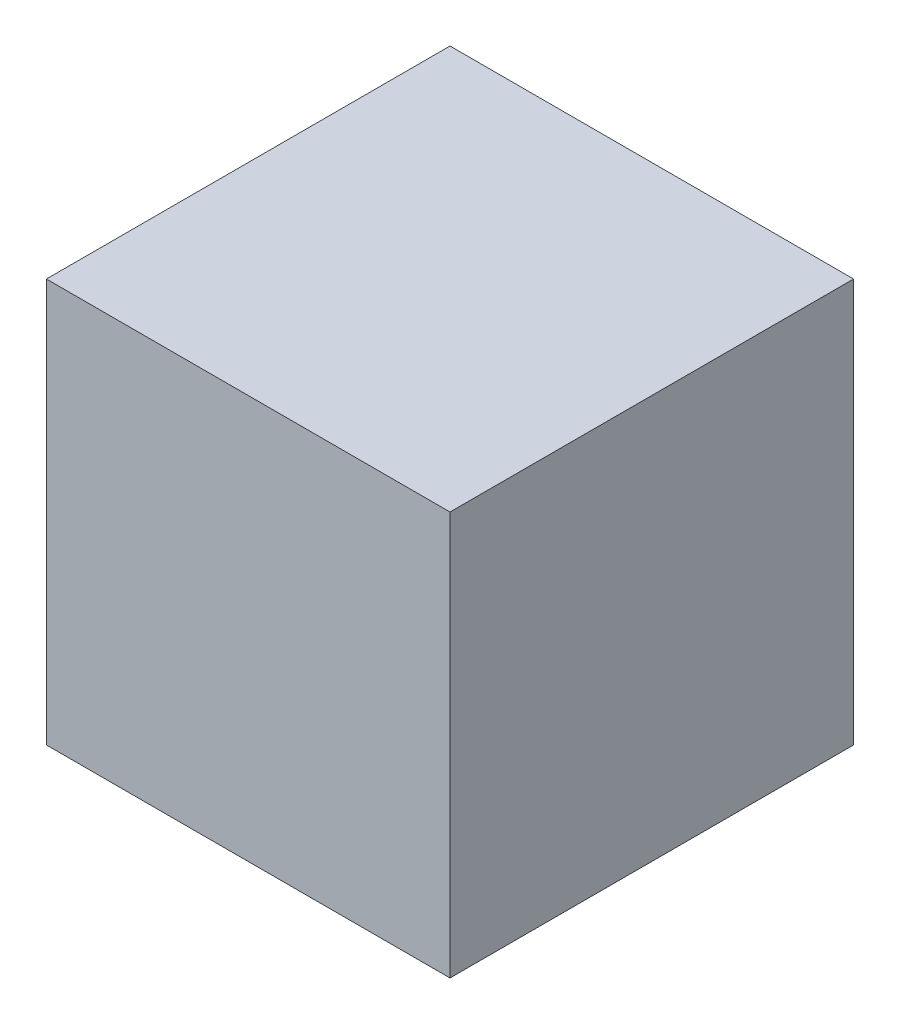
ISO-10303-21;
HEADER;
FILE_DESCRIPTION(('STEP AP214'),'2;1');
FILE_NAME('part.step','',(''),(''),'','','');
FILE_SCHEMA(('AUTOMOTIVE_DESIGN { 1 0 10303 214 1 1 1 1 }'));
ENDSEC;
DATA;
#1=APPLICATION_CONTEXT('core data for automotive mechanical design processes');
#2=APPLICATION_PROTOCOL_DEFINITION('international standard','automotive_design',2000,#1);
#3=PRODUCT_CONTEXT('',#1,'mechanical');
#4=PRODUCT('Part','Part','',(#3));
#5=PRODUCT_RELATED_PRODUCT_CATEGORY('part','',(#4));
#6=PRODUCT_DEFINITION_FORMATION('','',#4);
#7=PRODUCT_DEFINITION_CONTEXT('part definition',#1,'design');
#8=PRODUCT_DEFINITION('design','',#6,#7);
#9=PRODUCT_DEFINITION_SHAPE('','',#8);
#10=(LENGTH_UNIT() NAMED_UNIT(*) SI_UNIT(.MILLI.,.METRE.));
#11=(NAMED_UNIT(*) PLANE_ANGLE_UNIT() SI_UNIT($,.RADIAN.));
#12=(NAMED_UNIT(*) SI_UNIT($,.STERADIAN.) SOLID_ANGLE_UNIT());
#13=UNCERTAINTY_MEASURE_WITH_UNIT(LENGTH_MEASURE(1.E-05),#10,'distance_accuracy_value','');
#14=(GEOMETRIC_REPRESENTATION_CONTEXT(3) GLOBAL_UNCERTAINTY_ASSIGNED_CONTEXT((#13)) GLOBAL_UNIT_ASSIGNED_CONTEXT((#10,
#11,#12)) REPRESENTATION_CONTEXT('',''));
#15=CARTESIAN_POINT('',(0.,0.,0.));
#16=DIRECTION('',(0.,0.,1.));
#17=DIRECTION('',(1.,0.,0.));
#18=AXIS2_PLACEMENT_3D('',#15,#16,#17);
#19=CARTESIAN_POINT('',(0.,50.8,0.));
#20=DIRECTION('',(0.,1.,0.));
#21=DIRECTION('',(0.,0.,1.));
#22=AXIS2_PLACEMENT_3D('',#19,#20,#21);
#23=PLANE('',#22);
#24=DIRECTION('',(0.,0.,1.));
#25=VECTOR('',#24,1.);
#26=CARTESIAN_POINT('',(0.,50.8,0.));
#27=LINE('',#26,#25);
#28=CARTESIAN_POINT('',(0.,50.8,-50.8));
#29=VERTEX_POINT('',#28);
#30=CARTESIAN_POINT('',(0.,50.8,0.));
#31=VERTEX_POINT('',#30);
#32=EDGE_CURVE('E158',#29,#31,#27,.T.);
#33=ORIENTED_EDGE('',*,*,#32,.T.);
#34=DIRECTION('',(1.,0.,0.));
#35=VECTOR('',#34,1.);
#36=CARTESIAN_POINT('',(0.,50.8,0.));
#37=LINE('',#36,#35);
#38=CARTESIAN_POINT('',(50.8,50.8,0.));
#39=VERTEX_POINT('',#38);
#40=EDGE_CURVE('E161',#31,#39,#37,.T.);
#41=ORIENTED_EDGE('',*,*,#40,.T.);
#42=DIRECTION('',(0.,0.,-1.));
#43=VECTOR('',#42,1.);
#44=CARTESIAN_POINT('',(50.8,50.8,0.));
#45=LINE('',#44,#43);
#46=CARTESIAN_POINT('',(50.8,50.8,-50.8));
#47=VERTEX_POINT('',#46);
#48=EDGE_CURVE('E164',#39,#47,#45,.T.);
#49=ORIENTED_EDGE('',*,*,#48,.T.);
#50=DIRECTION('',(-1.,0.,0.));
#51=VECTOR('',#50,1.);
#52=CARTESIAN_POINT('',(0.,50.8,-50.8));
#53=LINE('',#52,#51);
#54=EDGE_CURVE('E166',#47,#29,#53,.T.);
#55=ORIENTED_EDGE('',*,*,#54,.T.);
#56=EDGE_LOOP('',(#33,#41,#49,#55));
#57=FACE_BOUND('',#56,.T.);
#58=ADVANCED_FACE('F58',(#57),#23,.T.);
#59=CARTESIAN_POINT('',(0.,0.,0.));
#60=DIRECTION('',(0.,1.,0.));
#61=DIRECTION('',(0.,0.,1.));
#62=AXIS2_PLACEMENT_3D('',#59,#60,#61);
#63=PLANE('',#62);
#64=DIRECTION('',(0.,0.,1.));
#65=VECTOR('',#64,1.);
#66=CARTESIAN_POINT('',(0.,0.,0.));
#67=LINE('',#66,#65);
#68=CARTESIAN_POINT('',(0.,0.,-50.8));
#69=VERTEX_POINT('',#68);
#70=CARTESIAN_POINT('',(0.,0.,0.));
#71=VERTEX_POINT('',#70);
#72=EDGE_CURVE('E157',#69,#71,#67,.T.);
#73=ORIENTED_EDGE('',*,*,#72,.F.);
#74=DIRECTION('',(-1.,0.,0.));
#75=VECTOR('',#74,1.);
#76=CARTESIAN_POINT('',(0.,0.,-50.8));
#77=LINE('',#76,#75);
#78=CARTESIAN_POINT('',(50.8,0.,-50.8));
#79=VERTEX_POINT('',#78);
#80=EDGE_CURVE('E162',#79,#69,#77,.T.);
#81=ORIENTED_EDGE('',*,*,#80,.F.);
#82=DIRECTION('',(0.,0.,-1.));
#83=VECTOR('',#82,1.);
#84=CARTESIAN_POINT('',(50.8,0.,0.));
#85=LINE('',#84,#83);
#86=CARTESIAN_POINT('',(50.8,0.,0.));
#87=VERTEX_POINT('',#86);
#88=EDGE_CURVE('E173',#87,#79,#85,.T.);
#89=ORIENTED_EDGE('',*,*,#88,.F.);
#90=DIRECTION('',(1.,0.,0.));
#91=VECTOR('',#90,1.);
#92=CARTESIAN_POINT('',(0.,0.,0.));
#93=LINE('',#92,#91);
#94=EDGE_CURVE('E171',#71,#87,#93,.T.);
#95=ORIENTED_EDGE('',*,*,#94,.F.);
#96=EDGE_LOOP('',(#73,#81,#89,#95));
#97=FACE_BOUND('',#96,.T.);
#98=ADVANCED_FACE('F194',(#97),#63,.F.);
#99=CARTESIAN_POINT('',(0.,50.8,0.));
#100=DIRECTION('',(1.,0.,0.));
#101=DIRECTION('',(0.,0.,-1.));
#102=AXIS2_PLACEMENT_3D('',#99,#100,#101);
#103=PLANE('',#102);
#104=ORIENTED_EDGE('',*,*,#72,.T.);
#105=DIRECTION('',(0.,-1.,0.));
#106=VECTOR('',#105,1.);
#107=CARTESIAN_POINT('',(0.,50.8,0.));
#108=LINE('',#107,#106);
#109=EDGE_CURVE('E67',#31,#71,#108,.T.);
#110=ORIENTED_EDGE('',*,*,#109,.F.);
#111=ORIENTED_EDGE('',*,*,#32,.F.);
#112=DIRECTION('',(0.,-1.,0.));
#113=VECTOR('',#112,1.);
#114=CARTESIAN_POINT('',(0.,50.8,-50.8));
#115=LINE('',#114,#113);
#116=EDGE_CURVE('E168',#29,#69,#115,.T.);
#117=ORIENTED_EDGE('',*,*,#116,.T.);
#118=EDGE_LOOP('',(#104,#110,#111,#117));
#119=FACE_BOUND('',#118,.T.);
#120=ADVANCED_FACE('F60',(#119),#103,.F.);
#121=CARTESIAN_POINT('',(0.,50.8,0.));
#122=DIRECTION('',(0.,0.,-1.));
#123=DIRECTION('',(-1.,0.,0.));
#124=AXIS2_PLACEMENT_3D('',#121,#122,#123);
#125=PLANE('',#124);
#126=ORIENTED_EDGE('',*,*,#94,.T.);
#127=DIRECTION('',(0.,-1.,0.));
#128=VECTOR('',#127,1.);
#129=CARTESIAN_POINT('',(50.8,50.8,0.));
#130=LINE('',#129,#128);
#131=EDGE_CURVE('E181',#39,#87,#130,.T.);
#132=ORIENTED_EDGE('',*,*,#131,.F.);
#133=ORIENTED_EDGE('',*,*,#40,.F.);
#134=ORIENTED_EDGE('',*,*,#109,.T.);
#135=EDGE_LOOP('',(#126,#132,#133,#134));
#136=FACE_BOUND('',#135,.T.);
#137=ADVANCED_FACE('F186',(#136),#125,.F.);
#138=CARTESIAN_POINT('',(50.8,50.8,0.));
#139=DIRECTION('',(-1.,0.,0.));
#140=DIRECTION('',(0.,0.,1.));
#141=AXIS2_PLACEMENT_3D('',#138,#139,#140);
#142=PLANE('',#141);
#143=ORIENTED_EDGE('',*,*,#88,.T.);
#144=DIRECTION('',(0.,-1.,0.));
#145=VECTOR('',#144,1.);
#146=CARTESIAN_POINT('',(50.8,50.8,-50.8));
#147=LINE('',#146,#145);
#148=EDGE_CURVE('E178',#47,#79,#147,.T.);
#149=ORIENTED_EDGE('',*,*,#148,.F.);
#150=ORIENTED_EDGE('',*,*,#48,.F.);
#151=ORIENTED_EDGE('',*,*,#131,.T.);
#152=EDGE_LOOP('',(#143,#149,#150,#151));
#153=FACE_BOUND('',#152,.T.);
#154=ADVANCED_FACE('F198',(#153),#142,.F.);
#155=CARTESIAN_POINT('',(0.,50.8,-50.8));
#156=DIRECTION('',(0.,0.,1.));
#157=DIRECTION('',(1.,0.,0.));
#158=AXIS2_PLACEMENT_3D('',#155,#156,#157);
#159=PLANE('',#158);
#160=ORIENTED_EDGE('',*,*,#80,.T.);
#161=ORIENTED_EDGE('',*,*,#116,.F.);
#162=ORIENTED_EDGE('',*,*,#54,.F.);
#163=ORIENTED_EDGE('',*,*,#148,.T.);
#164=EDGE_LOOP('',(#160,#161,#162,#163));
#165=FACE_BOUND('',#164,.T.);
#166=ADVANCED_FACE('F202',(#165),#159,.F.);
#167=CLOSED_SHELL('',(#58,#98,#120,#137,#154,#166));
#168=CARTESIAN_POINT('',(0.,6.35,0.));
#169=DIRECTION('',(0.,1.,0.));
#170=DIRECTION('',(0.,0.,1.));
#171=AXIS2_PLACEMENT_3D('',#168,#169,#170);
#172=PLANE('',#171);
#173=DIRECTION('',(0.,0.,-1.));
#174=VECTOR('',#173,1.);
#175=CARTESIAN_POINT('',(6.35,6.35,-44.45));
#176=LINE('',#175,#174);
#177=CARTESIAN_POINT('',(6.35,6.35,-6.35));
#178=VERTEX_POINT('',#177);
#179=CARTESIAN_POINT('',(6.35,6.35,-44.45));
#180=VERTEX_POINT('',#179);
#181=EDGE_CURVE('E137',#178,#180,#176,.T.);
#182=ORIENTED_EDGE('',*,*,#181,.F.);
#183=DIRECTION('',(1.,0.,0.));
#184=VECTOR('',#183,1.);
#185=CARTESIAN_POINT('',(0.,6.35,-6.35));
#186=LINE('',#185,#184);
#187=CARTESIAN_POINT('',(44.45,6.35,-6.35));
#188=VERTEX_POINT('',#187);
#189=EDGE_CURVE('E74',#178,#188,#186,.T.);
#190=ORIENTED_EDGE('',*,*,#189,.T.);
#191=DIRECTION('',(0.,0.,1.));
#192=VECTOR('',#191,1.);
#193=CARTESIAN_POINT('',(44.45,6.35,-44.45));
#194=LINE('',#193,#192);
#195=CARTESIAN_POINT('',(44.45,6.35,-44.45));
#196=VERTEX_POINT('',#195);
#197=EDGE_CURVE('E82',#196,#188,#194,.T.);
#198=ORIENTED_EDGE('',*,*,#197,.F.);
#199=DIRECTION('',(1.,0.,0.));
#200=VECTOR('',#199,1.);
#201=CARTESIAN_POINT('',(6.35,6.35,-44.45));
#202=LINE('',#201,#200);
#203=EDGE_CURVE('E130',#180,#196,#202,.T.);
#204=ORIENTED_EDGE('',*,*,#203,.F.);
#205=EDGE_LOOP('',(#182,#190,#198,#204));
#206=FACE_BOUND('',#205,.T.);
#207=ADVANCED_FACE('F142',(#206),#172,.T.);
#208=CARTESIAN_POINT('',(0.,44.45,0.));
#209=DIRECTION('',(0.,-1.,0.));
#210=DIRECTION('',(0.,0.,-1.));
#211=AXIS2_PLACEMENT_3D('',#208,#209,#210);
#212=PLANE('',#211);
#213=DIRECTION('',(0.,0.,1.));
#214=VECTOR('',#213,1.);
#215=CARTESIAN_POINT('',(6.35,44.45,-6.35));
#216=LINE('',#215,#214);
#217=CARTESIAN_POINT('',(6.35,44.45,-44.45));
#218=VERTEX_POINT('',#217);
#219=CARTESIAN_POINT('',(6.35,44.45,-6.35));
#220=VERTEX_POINT('',#219);
#221=EDGE_CURVE('E147',#218,#220,#216,.T.);
#222=ORIENTED_EDGE('',*,*,#221,.F.);
#223=DIRECTION('',(1.,0.,0.));
#224=VECTOR('',#223,1.);
#225=CARTESIAN_POINT('',(0.,44.45,-44.45));
#226=LINE('',#225,#224);
#227=CARTESIAN_POINT('',(44.45,44.45,-44.45));
#228=VERTEX_POINT('',#227);
#229=EDGE_CURVE('E12',#218,#228,#226,.T.);
#230=ORIENTED_EDGE('',*,*,#229,.T.);
#231=DIRECTION('',(0.,0.,-1.));
#232=VECTOR('',#231,1.);
#233=CARTESIAN_POINT('',(44.45,44.45,-6.35));
#234=LINE('',#233,#232);
#235=CARTESIAN_POINT('',(44.45,44.45,-6.35));
#236=VERTEX_POINT('',#235);
#237=EDGE_CURVE('E134',#236,#228,#234,.T.);
#238=ORIENTED_EDGE('',*,*,#237,.F.);
#239=DIRECTION('',(1.,0.,0.));
#240=VECTOR('',#239,1.);
#241=CARTESIAN_POINT('',(6.35,44.45,-6.35));
#242=LINE('',#241,#240);
#243=EDGE_CURVE('E149',#220,#236,#242,.T.);
#244=ORIENTED_EDGE('',*,*,#243,.F.);
#245=EDGE_LOOP('',(#222,#230,#238,#244));
#246=FACE_BOUND('',#245,.T.);
#247=ADVANCED_FACE('F235',(#246),#212,.T.);
#248=CARTESIAN_POINT('',(0.,50.8,-44.45));
#249=DIRECTION('',(0.,0.,1.));
#250=DIRECTION('',(1.,0.,0.));
#251=AXIS2_PLACEMENT_3D('',#248,#249,#250);
#252=PLANE('',#251);
#253=ORIENTED_EDGE('',*,*,#203,.T.);
#254=DIRECTION('',(0.,-1.,0.));
#255=VECTOR('',#254,1.);
#256=CARTESIAN_POINT('',(44.45,50.8,-44.45));
#257=LINE('',#256,#255);
#258=EDGE_CURVE('E133',#228,#196,#257,.T.);
#259=ORIENTED_EDGE('',*,*,#258,.F.);
#260=ORIENTED_EDGE('',*,*,#229,.F.);
#261=DIRECTION('',(0.,-1.,0.));
#262=VECTOR('',#261,1.);
#263=CARTESIAN_POINT('',(6.35,50.8,-44.45));
#264=LINE('',#263,#262);
#265=EDGE_CURVE('E126',#218,#180,#264,.T.);
#266=ORIENTED_EDGE('',*,*,#265,.T.);
#267=EDGE_LOOP('',(#253,#259,#260,#266));
#268=FACE_BOUND('',#267,.T.);
#269=ADVANCED_FACE('F128',(#268),#252,.T.);
#270=CARTESIAN_POINT('',(44.45,50.8,0.));
#271=DIRECTION('',(-1.,0.,0.));
#272=DIRECTION('',(0.,0.,1.));
#273=AXIS2_PLACEMENT_3D('',#270,#271,#272);
#274=PLANE('',#273);
#275=ORIENTED_EDGE('',*,*,#197,.T.);
#276=DIRECTION('',(0.,-1.,0.));
#277=VECTOR('',#276,1.);
#278=CARTESIAN_POINT('',(44.45,50.8,-6.35));
#279=LINE('',#278,#277);
#280=EDGE_CURVE('E154',#236,#188,#279,.T.);
#281=ORIENTED_EDGE('',*,*,#280,.F.);
#282=ORIENTED_EDGE('',*,*,#237,.T.);
#283=ORIENTED_EDGE('',*,*,#258,.T.);
#284=EDGE_LOOP('',(#275,#281,#282,#283));
#285=FACE_BOUND('',#284,.T.);
#286=ADVANCED_FACE('F250',(#285),#274,.T.);
#287=CARTESIAN_POINT('',(0.,50.8,-6.35));
#288=DIRECTION('',(0.,0.,-1.));
#289=DIRECTION('',(-1.,0.,0.));
#290=AXIS2_PLACEMENT_3D('',#287,#288,#289);
#291=PLANE('',#290);
#292=ORIENTED_EDGE('',*,*,#189,.F.);
#293=DIRECTION('',(0.,-1.,0.));
#294=VECTOR('',#293,1.);
#295=CARTESIAN_POINT('',(6.35,50.8,-6.35));
#296=LINE('',#295,#294);
#297=EDGE_CURVE('E139',#220,#178,#296,.T.);
#298=ORIENTED_EDGE('',*,*,#297,.F.);
#299=ORIENTED_EDGE('',*,*,#243,.T.);
#300=ORIENTED_EDGE('',*,*,#280,.T.);
#301=EDGE_LOOP('',(#292,#298,#299,#300));
#302=FACE_BOUND('',#301,.T.);
#303=ADVANCED_FACE('F260',(#302),#291,.T.);
#304=CARTESIAN_POINT('',(6.35,50.8,0.));
#305=DIRECTION('',(1.,0.,0.));
#306=DIRECTION('',(0.,0.,-1.));
#307=AXIS2_PLACEMENT_3D('',#304,#305,#306);
#308=PLANE('',#307);
#309=ORIENTED_EDGE('',*,*,#181,.T.);
#310=ORIENTED_EDGE('',*,*,#265,.F.);
#311=ORIENTED_EDGE('',*,*,#221,.T.);
#312=ORIENTED_EDGE('',*,*,#297,.T.);
#313=EDGE_LOOP('',(#309,#310,#311,#312));
#314=FACE_BOUND('',#313,.T.);
#315=ADVANCED_FACE('F138',(#314),#308,.T.);
#316=CLOSED_SHELL('',(#207,#247,#269,#286,#303,#315));
#317=ORIENTED_CLOSED_SHELL('',*,#316,.T.);
#318=BREP_WITH_VOIDS('B2',#167,(#317));
#319=ADVANCED_BREP_SHAPE_REPRESENTATION('',(#18,#318),#14);
#320=SHAPE_DEFINITION_REPRESENTATION(#9,#319);
ENDSEC;
END-ISO-10303-21;
